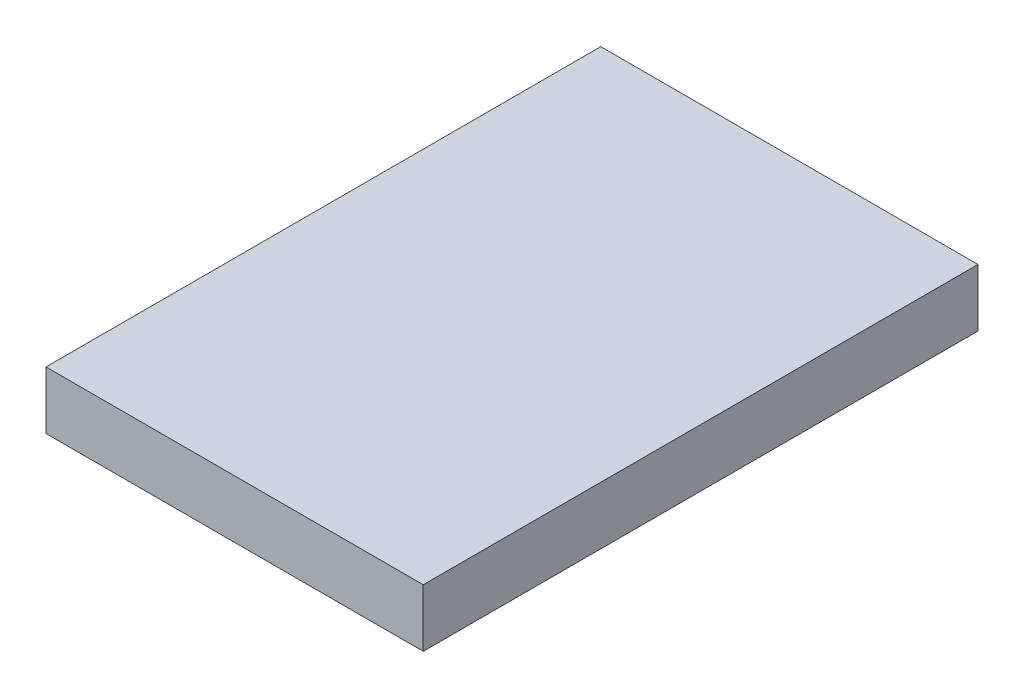
ISO-10303-21;
HEADER;
FILE_DESCRIPTION(('STEP AP214'),'2;1');
FILE_NAME('part.step','',(''),(''),'','','');
FILE_SCHEMA(('AUTOMOTIVE_DESIGN { 1 0 10303 214 1 1 1 1 }'));
ENDSEC;
DATA;
#1=APPLICATION_CONTEXT('core data for automotive mechanical design processes');
#2=APPLICATION_PROTOCOL_DEFINITION('international standard','automotive_design',2000,#1);
#3=PRODUCT_CONTEXT('',#1,'mechanical');
#4=PRODUCT('Part','Part','',(#3));
#5=PRODUCT_RELATED_PRODUCT_CATEGORY('part','',(#4));
#6=PRODUCT_DEFINITION_FORMATION('','',#4);
#7=PRODUCT_DEFINITION_CONTEXT('part definition',#1,'design');
#8=PRODUCT_DEFINITION('design','',#6,#7);
#9=PRODUCT_DEFINITION_SHAPE('','',#8);
#10=(LENGTH_UNIT() NAMED_UNIT(*) SI_UNIT(.MILLI.,.METRE.));
#11=(NAMED_UNIT(*) PLANE_ANGLE_UNIT() SI_UNIT($,.RADIAN.));
#12=(NAMED_UNIT(*) SI_UNIT($,.STERADIAN.) SOLID_ANGLE_UNIT());
#13=UNCERTAINTY_MEASURE_WITH_UNIT(LENGTH_MEASURE(1.E-05),#10,'distance_accuracy_value','');
#14=(GEOMETRIC_REPRESENTATION_CONTEXT(3) GLOBAL_UNCERTAINTY_ASSIGNED_CONTEXT((#13)) GLOBAL_UNIT_ASSIGNED_CONTEXT((#10,
#11,#12)) REPRESENTATION_CONTEXT('',''));
#15=CARTESIAN_POINT('',(0.,0.,0.));
#16=DIRECTION('',(0.,0.,1.));
#17=DIRECTION('',(1.,0.,0.));
#18=AXIS2_PLACEMENT_3D('',#15,#16,#17);
#19=CARTESIAN_POINT('',(0.,5.2,0.));
#20=DIRECTION('',(1.,0.,0.));
#21=DIRECTION('',(0.,0.,-1.));
#22=AXIS2_PLACEMENT_3D('',#19,#20,#21);
#23=PLANE('',#22);
#24=DIRECTION('',(0.,0.,1.));
#25=VECTOR('',#24,1.);
#26=CARTESIAN_POINT('',(0.,0.,0.));
#27=LINE('',#26,#25);
#28=CARTESIAN_POINT('',(0.,0.,-50.));
#29=VERTEX_POINT('',#28);
#30=CARTESIAN_POINT('',(0.,0.,0.));
#31=VERTEX_POINT('',#30);
#32=EDGE_CURVE('E101',#29,#31,#27,.T.);
#33=ORIENTED_EDGE('',*,*,#32,.T.);
#34=DIRECTION('',(0.,-1.,0.));
#35=VECTOR('',#34,1.);
#36=CARTESIAN_POINT('',(0.,5.2,0.));
#37=LINE('',#36,#35);
#38=CARTESIAN_POINT('',(0.,5.2,0.));
#39=VERTEX_POINT('',#38);
#40=EDGE_CURVE('E11',#39,#31,#37,.T.);
#41=ORIENTED_EDGE('',*,*,#40,.F.);
#42=DIRECTION('',(0.,0.,1.));
#43=VECTOR('',#42,1.);
#44=CARTESIAN_POINT('',(0.,5.2,0.));
#45=LINE('',#44,#43);
#46=CARTESIAN_POINT('',(0.,5.2,-50.));
#47=VERTEX_POINT('',#46);
#48=EDGE_CURVE('E89',#47,#39,#45,.T.);
#49=ORIENTED_EDGE('',*,*,#48,.F.);
#50=DIRECTION('',(0.,-1.,0.));
#51=VECTOR('',#50,1.);
#52=CARTESIAN_POINT('',(0.,5.2,-50.));
#53=LINE('',#52,#51);
#54=EDGE_CURVE('E97',#47,#29,#53,.T.);
#55=ORIENTED_EDGE('',*,*,#54,.T.);
#56=EDGE_LOOP('',(#33,#41,#49,#55));
#57=FACE_BOUND('',#56,.T.);
#58=ADVANCED_FACE('F38',(#57),#23,.F.);
#59=CARTESIAN_POINT('',(0.,5.2,0.));
#60=DIRECTION('',(0.,0.,-1.));
#61=DIRECTION('',(-1.,0.,0.));
#62=AXIS2_PLACEMENT_3D('',#59,#60,#61);
#63=PLANE('',#62);
#64=DIRECTION('',(1.,0.,0.));
#65=VECTOR('',#64,1.);
#66=CARTESIAN_POINT('',(0.,0.,0.));
#67=LINE('',#66,#65);
#68=CARTESIAN_POINT('',(34.,0.,0.));
#69=VERTEX_POINT('',#68);
#70=EDGE_CURVE('E93',#31,#69,#67,.T.);
#71=ORIENTED_EDGE('',*,*,#70,.T.);
#72=DIRECTION('',(0.,-1.,0.));
#73=VECTOR('',#72,1.);
#74=CARTESIAN_POINT('',(34.,5.2,0.));
#75=LINE('',#74,#73);
#76=CARTESIAN_POINT('',(34.,5.2,0.));
#77=VERTEX_POINT('',#76);
#78=EDGE_CURVE('E46',#77,#69,#75,.T.);
#79=ORIENTED_EDGE('',*,*,#78,.F.);
#80=DIRECTION('',(1.,0.,0.));
#81=VECTOR('',#80,1.);
#82=CARTESIAN_POINT('',(0.,5.2,0.));
#83=LINE('',#82,#81);
#84=EDGE_CURVE('E84',#39,#77,#83,.T.);
#85=ORIENTED_EDGE('',*,*,#84,.F.);
#86=ORIENTED_EDGE('',*,*,#40,.T.);
#87=EDGE_LOOP('',(#71,#79,#85,#86));
#88=FACE_BOUND('',#87,.T.);
#89=ADVANCED_FACE('F92',(#88),#63,.F.);
#90=CARTESIAN_POINT('',(34.,5.2,0.));
#91=DIRECTION('',(-1.,0.,0.));
#92=DIRECTION('',(0.,0.,1.));
#93=AXIS2_PLACEMENT_3D('',#90,#91,#92);
#94=PLANE('',#93);
#95=DIRECTION('',(0.,0.,-1.));
#96=VECTOR('',#95,1.);
#97=CARTESIAN_POINT('',(34.,0.,0.));
#98=LINE('',#97,#96);
#99=CARTESIAN_POINT('',(34.,0.,-50.));
#100=VERTEX_POINT('',#99);
#101=EDGE_CURVE('E71',#69,#100,#98,.T.);
#102=ORIENTED_EDGE('',*,*,#101,.T.);
#103=DIRECTION('',(0.,-1.,0.));
#104=VECTOR('',#103,1.);
#105=CARTESIAN_POINT('',(34.,5.2,-50.));
#106=LINE('',#105,#104);
#107=CARTESIAN_POINT('',(34.,5.2,-50.));
#108=VERTEX_POINT('',#107);
#109=EDGE_CURVE('E94',#108,#100,#106,.T.);
#110=ORIENTED_EDGE('',*,*,#109,.F.);
#111=DIRECTION('',(0.,0.,-1.));
#112=VECTOR('',#111,1.);
#113=CARTESIAN_POINT('',(34.,5.2,0.));
#114=LINE('',#113,#112);
#115=EDGE_CURVE('E87',#77,#108,#114,.T.);
#116=ORIENTED_EDGE('',*,*,#115,.F.);
#117=ORIENTED_EDGE('',*,*,#78,.T.);
#118=EDGE_LOOP('',(#102,#110,#116,#117));
#119=FACE_BOUND('',#118,.T.);
#120=ADVANCED_FACE('F95',(#119),#94,.F.);
#121=CARTESIAN_POINT('',(0.,5.2,-50.));
#122=DIRECTION('',(0.,0.,1.));
#123=DIRECTION('',(1.,0.,0.));
#124=AXIS2_PLACEMENT_3D('',#121,#122,#123);
#125=PLANE('',#124);
#126=DIRECTION('',(-1.,0.,0.));
#127=VECTOR('',#126,1.);
#128=CARTESIAN_POINT('',(0.,0.,-50.));
#129=LINE('',#128,#127);
#130=EDGE_CURVE('E77',#100,#29,#129,.T.);
#131=ORIENTED_EDGE('',*,*,#130,.T.);
#132=ORIENTED_EDGE('',*,*,#54,.F.);
#133=DIRECTION('',(-1.,0.,0.));
#134=VECTOR('',#133,1.);
#135=CARTESIAN_POINT('',(0.,5.2,-50.));
#136=LINE('',#135,#134);
#137=EDGE_CURVE('E54',#108,#47,#136,.T.);
#138=ORIENTED_EDGE('',*,*,#137,.F.);
#139=ORIENTED_EDGE('',*,*,#109,.T.);
#140=EDGE_LOOP('',(#131,#132,#138,#139));
#141=FACE_BOUND('',#140,.T.);
#142=ADVANCED_FACE('F108',(#141),#125,.F.);
#143=CARTESIAN_POINT('',(0.,5.2,0.));
#144=DIRECTION('',(0.,-1.,0.));
#145=DIRECTION('',(0.,0.,-1.));
#146=AXIS2_PLACEMENT_3D('',#143,#144,#145);
#147=PLANE('',#146);
#148=ORIENTED_EDGE('',*,*,#48,.T.);
#149=ORIENTED_EDGE('',*,*,#84,.T.);
#150=ORIENTED_EDGE('',*,*,#115,.T.);
#151=ORIENTED_EDGE('',*,*,#137,.T.);
#152=EDGE_LOOP('',(#148,#149,#150,#151));
#153=FACE_BOUND('',#152,.T.);
#154=ADVANCED_FACE('F85',(#153),#147,.F.);
#155=CARTESIAN_POINT('',(0.,0.,0.));
#156=DIRECTION('',(0.,-1.,0.));
#157=DIRECTION('',(0.,0.,-1.));
#158=AXIS2_PLACEMENT_3D('',#155,#156,#157);
#159=PLANE('',#158);
#160=ORIENTED_EDGE('',*,*,#32,.F.);
#161=ORIENTED_EDGE('',*,*,#130,.F.);
#162=ORIENTED_EDGE('',*,*,#101,.F.);
#163=ORIENTED_EDGE('',*,*,#70,.F.);
#164=EDGE_LOOP('',(#160,#161,#162,#163));
#165=FACE_BOUND('',#164,.T.);
#166=ADVANCED_FACE('F111',(#165),#159,.T.);
#167=CLOSED_SHELL('',(#58,#89,#120,#142,#154,#166));
#168=MANIFOLD_SOLID_BREP('B2',#167);
#169=ADVANCED_BREP_SHAPE_REPRESENTATION('',(#18,#168),#14);
#170=SHAPE_DEFINITION_REPRESENTATION(#9,#169);
ENDSEC;
END-ISO-10303-21;
